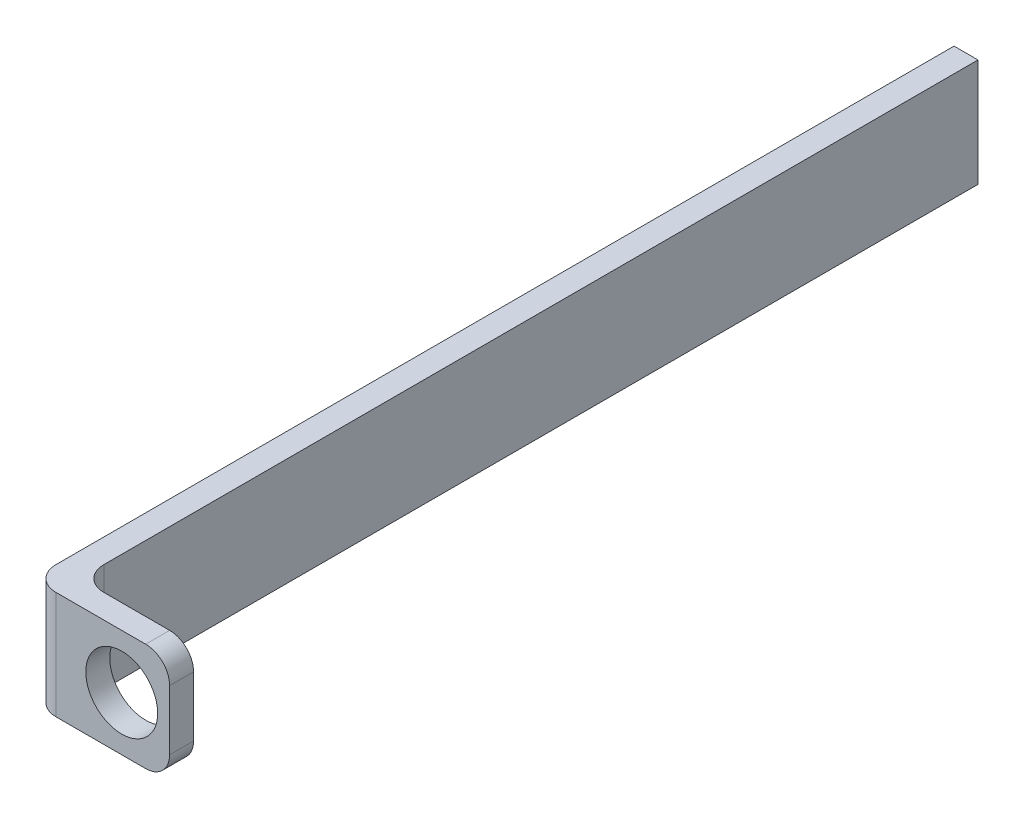
ISO-10303-21;
HEADER;
FILE_DESCRIPTION(('STEP AP214'),'2;1');
FILE_NAME('part.step','',(''),(''),'','','');
FILE_SCHEMA(('AUTOMOTIVE_DESIGN { 1 0 10303 214 1 1 1 1 }'));
ENDSEC;
DATA;
#1=APPLICATION_CONTEXT('core data for automotive mechanical design processes');
#2=APPLICATION_PROTOCOL_DEFINITION('international standard','automotive_design',2000,#1);
#3=PRODUCT_CONTEXT('',#1,'mechanical');
#4=PRODUCT('Part','Part','',(#3));
#5=PRODUCT_RELATED_PRODUCT_CATEGORY('part','',(#4));
#6=PRODUCT_DEFINITION_FORMATION('','',#4);
#7=PRODUCT_DEFINITION_CONTEXT('part definition',#1,'design');
#8=PRODUCT_DEFINITION('design','',#6,#7);
#9=PRODUCT_DEFINITION_SHAPE('','',#8);
#10=(LENGTH_UNIT() NAMED_UNIT(*) SI_UNIT(.MILLI.,.METRE.));
#11=(NAMED_UNIT(*) PLANE_ANGLE_UNIT() SI_UNIT($,.RADIAN.));
#12=(NAMED_UNIT(*) SI_UNIT($,.STERADIAN.) SOLID_ANGLE_UNIT());
#13=UNCERTAINTY_MEASURE_WITH_UNIT(LENGTH_MEASURE(1.E-05),#10,'distance_accuracy_value','');
#14=(GEOMETRIC_REPRESENTATION_CONTEXT(3) GLOBAL_UNCERTAINTY_ASSIGNED_CONTEXT((#13)) GLOBAL_UNIT_ASSIGNED_CONTEXT((#10,
#11,#12)) REPRESENTATION_CONTEXT('',''));
#15=CARTESIAN_POINT('',(0.,0.,0.));
#16=DIRECTION('',(0.,0.,1.));
#17=DIRECTION('',(1.,0.,0.));
#18=AXIS2_PLACEMENT_3D('',#15,#16,#17);
#19=CARTESIAN_POINT('',(1.99999999999999,-2.5,0.));
#20=DIRECTION('',(0.,0.,1.));
#21=DIRECTION('',(1.,0.,0.));
#22=AXIS2_PLACEMENT_3D('',#19,#20,#21);
#23=PLANE('',#22);
#24=CARTESIAN_POINT('',(0.,0.,0.));
#25=DIRECTION('',(0.,0.,1.));
#26=DIRECTION('',(1.,0.,0.));
#27=AXIS2_PLACEMENT_3D('',#24,#25,#26);
#28=CIRCLE('',#27,3.);
#29=CARTESIAN_POINT('',(3.,0.,0.));
#30=VERTEX_POINT('',#29);
#31=EDGE_CURVE('E153',#30,#30,#28,.T.);
#32=ORIENTED_EDGE('',*,*,#31,.T.);
#33=EDGE_LOOP('',(#32));
#34=FACE_BOUND('',#33,.T.);
#35=DIRECTION('',(1.,0.,0.));
#36=VECTOR('',#35,1.);
#37=CARTESIAN_POINT('',(-7.5,-4.5,0.));
#38=LINE('',#37,#36);
#39=CARTESIAN_POINT('',(-3.5,-4.5,0.));
#40=VERTEX_POINT('',#39);
#41=CARTESIAN_POINT('',(1.99999999999999,-4.5,0.));
#42=VERTEX_POINT('',#41);
#43=EDGE_CURVE('E158',#40,#42,#38,.T.);
#44=ORIENTED_EDGE('',*,*,#43,.F.);
#45=DIRECTION('',(0.,-1.,0.));
#46=VECTOR('',#45,1.);
#47=CARTESIAN_POINT('',(-3.5,4.5,0.));
#48=LINE('',#47,#46);
#49=CARTESIAN_POINT('',(-3.5,4.5,0.));
#50=VERTEX_POINT('',#49);
#51=EDGE_CURVE('E214',#40,#50,#48,.F.);
#52=ORIENTED_EDGE('',*,*,#51,.T.);
#53=DIRECTION('',(-1.,0.,0.));
#54=VECTOR('',#53,1.);
#55=CARTESIAN_POINT('',(-7.5,4.5,0.));
#56=LINE('',#55,#54);
#57=CARTESIAN_POINT('',(1.99999999999999,4.5,0.));
#58=VERTEX_POINT('',#57);
#59=EDGE_CURVE('E166',#58,#50,#56,.T.);
#60=ORIENTED_EDGE('',*,*,#59,.F.);
#61=CARTESIAN_POINT('',(1.99999999999999,2.5,0.));
#62=DIRECTION('',(0.,0.,1.));
#63=DIRECTION('',(-1.,0.,0.));
#64=AXIS2_PLACEMENT_3D('',#61,#62,#63);
#65=CIRCLE('',#64,2.);
#66=CARTESIAN_POINT('',(3.99999999999999,2.5,0.));
#67=VERTEX_POINT('',#66);
#68=EDGE_CURVE('E186',#67,#58,#65,.T.);
#69=ORIENTED_EDGE('',*,*,#68,.F.);
#70=DIRECTION('',(0.,1.,0.));
#71=VECTOR('',#70,1.);
#72=CARTESIAN_POINT('',(3.99999999999999,2.5,0.));
#73=LINE('',#72,#71);
#74=CARTESIAN_POINT('',(3.99999999999999,-2.5,0.));
#75=VERTEX_POINT('',#74);
#76=EDGE_CURVE('E183',#75,#67,#73,.T.);
#77=ORIENTED_EDGE('',*,*,#76,.F.);
#78=CARTESIAN_POINT('',(1.99999999999999,-2.5,0.));
#79=DIRECTION('',(0.,0.,1.));
#80=DIRECTION('',(1.,0.,0.));
#81=AXIS2_PLACEMENT_3D('',#78,#79,#80);
#82=CIRCLE('',#81,2.);
#83=EDGE_CURVE('E180',#42,#75,#82,.T.);
#84=ORIENTED_EDGE('',*,*,#83,.F.);
#85=EDGE_LOOP('',(#44,#52,#60,#69,#77,#84));
#86=FACE_BOUND('',#85,.T.);
#87=ADVANCED_FACE('F40',(#34,#86),#23,.F.);
#88=CARTESIAN_POINT('',(1.99999999999999,-2.5,2.));
#89=DIRECTION('',(0.,0.,1.));
#90=DIRECTION('',(1.,0.,0.));
#91=AXIS2_PLACEMENT_3D('',#88,#89,#90);
#92=PLANE('',#91);
#93=DIRECTION('',(-1.,0.,0.));
#94=VECTOR('',#93,1.);
#95=CARTESIAN_POINT('',(-7.5,4.5,2.));
#96=LINE('',#95,#94);
#97=CARTESIAN_POINT('',(1.99999999999999,4.5,2.));
#98=VERTEX_POINT('',#97);
#99=CARTESIAN_POINT('',(-5.5,4.5,2.));
#100=VERTEX_POINT('',#99);
#101=EDGE_CURVE('E124',#98,#100,#96,.T.);
#102=ORIENTED_EDGE('',*,*,#101,.T.);
#103=DIRECTION('',(0.,-1.,0.));
#104=VECTOR('',#103,1.);
#105=CARTESIAN_POINT('',(-5.5,-4.5,2.));
#106=LINE('',#105,#104);
#107=CARTESIAN_POINT('',(-5.5,-4.5,2.));
#108=VERTEX_POINT('',#107);
#109=EDGE_CURVE('E217',#100,#108,#106,.T.);
#110=ORIENTED_EDGE('',*,*,#109,.T.);
#111=DIRECTION('',(1.,0.,0.));
#112=VECTOR('',#111,1.);
#113=CARTESIAN_POINT('',(-7.5,-4.5,2.));
#114=LINE('',#113,#112);
#115=CARTESIAN_POINT('',(1.99999999999999,-4.5,2.));
#116=VERTEX_POINT('',#115);
#117=EDGE_CURVE('E162',#108,#116,#114,.T.);
#118=ORIENTED_EDGE('',*,*,#117,.T.);
#119=CARTESIAN_POINT('',(1.99999999999999,-2.5,2.));
#120=DIRECTION('',(0.,0.,1.));
#121=DIRECTION('',(1.,0.,0.));
#122=AXIS2_PLACEMENT_3D('',#119,#120,#121);
#123=CIRCLE('',#122,2.);
#124=CARTESIAN_POINT('',(3.99999999999999,-2.5,2.));
#125=VERTEX_POINT('',#124);
#126=EDGE_CURVE('E165',#116,#125,#123,.T.);
#127=ORIENTED_EDGE('',*,*,#126,.T.);
#128=DIRECTION('',(0.,1.,0.));
#129=VECTOR('',#128,1.);
#130=CARTESIAN_POINT('',(3.99999999999999,2.5,2.));
#131=LINE('',#130,#129);
#132=CARTESIAN_POINT('',(3.99999999999999,2.5,2.));
#133=VERTEX_POINT('',#132);
#134=EDGE_CURVE('E169',#125,#133,#131,.T.);
#135=ORIENTED_EDGE('',*,*,#134,.T.);
#136=CARTESIAN_POINT('',(1.99999999999999,2.5,2.));
#137=DIRECTION('',(0.,0.,1.));
#138=DIRECTION('',(-1.,0.,0.));
#139=AXIS2_PLACEMENT_3D('',#136,#137,#138);
#140=CIRCLE('',#139,2.);
#141=EDGE_CURVE('E172',#133,#98,#140,.T.);
#142=ORIENTED_EDGE('',*,*,#141,.T.);
#143=EDGE_LOOP('',(#102,#110,#118,#127,#135,#142));
#144=FACE_BOUND('',#143,.T.);
#145=CARTESIAN_POINT('',(0.,0.,2.));
#146=DIRECTION('',(0.,0.,1.));
#147=DIRECTION('',(1.,0.,0.));
#148=AXIS2_PLACEMENT_3D('',#145,#146,#147);
#149=CIRCLE('',#148,3.);
#150=CARTESIAN_POINT('',(3.,0.,2.));
#151=VERTEX_POINT('',#150);
#152=EDGE_CURVE('E154',#151,#151,#149,.T.);
#153=ORIENTED_EDGE('',*,*,#152,.F.);
#154=EDGE_LOOP('',(#153));
#155=FACE_BOUND('',#154,.T.);
#156=ADVANCED_FACE('F247',(#144,#155),#92,.T.);
#157=CARTESIAN_POINT('',(-7.5,4.5,2.));
#158=DIRECTION('',(1.,0.,0.));
#159=DIRECTION('',(0.,0.,-1.));
#160=AXIS2_PLACEMENT_3D('',#157,#158,#159);
#161=PLANE('',#160);
#162=DIRECTION('',(0.,0.,-1.));
#163=VECTOR('',#162,1.);
#164=CARTESIAN_POINT('',(-7.5,-4.5,2.));
#165=LINE('',#164,#163);
#166=CARTESIAN_POINT('',(-7.5,-4.5,0.));
#167=VERTEX_POINT('',#166);
#168=CARTESIAN_POINT('',(-7.5,-4.5,-75.));
#169=VERTEX_POINT('',#168);
#170=EDGE_CURVE('E207',#167,#169,#165,.T.);
#171=ORIENTED_EDGE('',*,*,#170,.F.);
#172=DIRECTION('',(0.,-1.,0.));
#173=VECTOR('',#172,1.);
#174=CARTESIAN_POINT('',(-7.5,4.5,0.));
#175=LINE('',#174,#173);
#176=CARTESIAN_POINT('',(-7.5,4.5,0.));
#177=VERTEX_POINT('',#176);
#178=EDGE_CURVE('E56',#167,#177,#175,.F.);
#179=ORIENTED_EDGE('',*,*,#178,.T.);
#180=DIRECTION('',(0.,0.,-1.));
#181=VECTOR('',#180,1.);
#182=CARTESIAN_POINT('',(-7.5,4.5,2.));
#183=LINE('',#182,#181);
#184=CARTESIAN_POINT('',(-7.5,4.5,-75.));
#185=VERTEX_POINT('',#184);
#186=EDGE_CURVE('E115',#177,#185,#183,.T.);
#187=ORIENTED_EDGE('',*,*,#186,.T.);
#188=DIRECTION('',(0.,1.,0.));
#189=VECTOR('',#188,1.);
#190=CARTESIAN_POINT('',(-7.5,4.5,-75.));
#191=LINE('',#190,#189);
#192=EDGE_CURVE('E119',#169,#185,#191,.T.);
#193=ORIENTED_EDGE('',*,*,#192,.F.);
#194=EDGE_LOOP('',(#171,#179,#187,#193));
#195=FACE_BOUND('',#194,.T.);
#196=ADVANCED_FACE('F117',(#195),#161,.F.);
#197=CARTESIAN_POINT('',(-7.5,-4.5,2.));
#198=DIRECTION('',(0.,1.,0.));
#199=DIRECTION('',(-1.,0.,0.));
#200=AXIS2_PLACEMENT_3D('',#197,#198,#199);
#201=PLANE('',#200);
#202=ORIENTED_EDGE('',*,*,#117,.F.);
#203=CARTESIAN_POINT('',(-5.5,-4.5,0.));
#204=DIRECTION('',(0.,1.,0.));
#205=DIRECTION('',(-1.,0.,0.));
#206=AXIS2_PLACEMENT_3D('',#203,#204,#205);
#207=CIRCLE('',#206,2.);
#208=EDGE_CURVE('E64',#108,#167,#207,.F.);
#209=ORIENTED_EDGE('',*,*,#208,.T.);
#210=ORIENTED_EDGE('',*,*,#170,.T.);
#211=DIRECTION('',(-1.,0.,0.));
#212=VECTOR('',#211,1.);
#213=CARTESIAN_POINT('',(-7.5,-4.5,-75.));
#214=LINE('',#213,#212);
#215=CARTESIAN_POINT('',(-5.5,-4.5,-75.));
#216=VERTEX_POINT('',#215);
#217=EDGE_CURVE('E139',#216,#169,#214,.T.);
#218=ORIENTED_EDGE('',*,*,#217,.F.);
#219=DIRECTION('',(0.,0.,1.));
#220=VECTOR('',#219,1.);
#221=CARTESIAN_POINT('',(-5.5,-4.5,-75.));
#222=LINE('',#221,#220);
#223=CARTESIAN_POINT('',(-5.5,-4.5,-2.));
#224=VERTEX_POINT('',#223);
#225=EDGE_CURVE('E147',#216,#224,#222,.T.);
#226=ORIENTED_EDGE('',*,*,#225,.T.);
#227=CARTESIAN_POINT('',(-3.5,-4.5,-2.));
#228=DIRECTION('',(0.,1.,0.));
#229=DIRECTION('',(-1.,0.,0.));
#230=AXIS2_PLACEMENT_3D('',#227,#228,#229);
#231=CIRCLE('',#230,2.);
#232=EDGE_CURVE('E49',#224,#40,#231,.T.);
#233=ORIENTED_EDGE('',*,*,#232,.T.);
#234=ORIENTED_EDGE('',*,*,#43,.T.);
#235=DIRECTION('',(0.,0.,-1.));
#236=VECTOR('',#235,1.);
#237=CARTESIAN_POINT('',(1.99999999999999,-4.5,2.));
#238=LINE('',#237,#236);
#239=EDGE_CURVE('E203',#116,#42,#238,.T.);
#240=ORIENTED_EDGE('',*,*,#239,.F.);
#241=EDGE_LOOP('',(#202,#209,#210,#218,#226,#233,#234,#240));
#242=FACE_BOUND('',#241,.T.);
#243=ADVANCED_FACE('F229',(#242),#201,.F.);
#244=CARTESIAN_POINT('',(1.99999999999999,-2.5,2.));
#245=DIRECTION('',(0.,0.,-1.));
#246=DIRECTION('',(-1.,0.,0.));
#247=AXIS2_PLACEMENT_3D('',#244,#245,#246);
#248=CYLINDRICAL_SURFACE('',#247,2.);
#249=ORIENTED_EDGE('',*,*,#83,.T.);
#250=DIRECTION('',(0.,0.,-1.));
#251=VECTOR('',#250,1.);
#252=CARTESIAN_POINT('',(3.99999999999999,-2.5,2.));
#253=LINE('',#252,#251);
#254=EDGE_CURVE('E199',#125,#75,#253,.T.);
#255=ORIENTED_EDGE('',*,*,#254,.F.);
#256=ORIENTED_EDGE('',*,*,#126,.F.);
#257=ORIENTED_EDGE('',*,*,#239,.T.);
#258=EDGE_LOOP('',(#249,#255,#256,#257));
#259=FACE_BOUND('',#258,.T.);
#260=ADVANCED_FACE('F261',(#259),#248,.T.);
#261=CARTESIAN_POINT('',(3.99999999999999,2.5,2.));
#262=DIRECTION('',(-1.,0.,0.));
#263=DIRECTION('',(0.,0.,1.));
#264=AXIS2_PLACEMENT_3D('',#261,#262,#263);
#265=PLANE('',#264);
#266=ORIENTED_EDGE('',*,*,#76,.T.);
#267=DIRECTION('',(0.,0.,-1.));
#268=VECTOR('',#267,1.);
#269=CARTESIAN_POINT('',(3.99999999999999,2.5,2.));
#270=LINE('',#269,#268);
#271=EDGE_CURVE('E195',#133,#67,#270,.T.);
#272=ORIENTED_EDGE('',*,*,#271,.F.);
#273=ORIENTED_EDGE('',*,*,#134,.F.);
#274=ORIENTED_EDGE('',*,*,#254,.T.);
#275=EDGE_LOOP('',(#266,#272,#273,#274));
#276=FACE_BOUND('',#275,.T.);
#277=ADVANCED_FACE('F257',(#276),#265,.F.);
#278=CARTESIAN_POINT('',(1.99999999999999,2.5,2.));
#279=DIRECTION('',(0.,0.,-1.));
#280=DIRECTION('',(-1.,0.,0.));
#281=AXIS2_PLACEMENT_3D('',#278,#279,#280);
#282=CYLINDRICAL_SURFACE('',#281,2.);
#283=ORIENTED_EDGE('',*,*,#68,.T.);
#284=DIRECTION('',(0.,0.,-1.));
#285=VECTOR('',#284,1.);
#286=CARTESIAN_POINT('',(1.99999999999999,4.5,2.));
#287=LINE('',#286,#285);
#288=EDGE_CURVE('E123',#98,#58,#287,.T.);
#289=ORIENTED_EDGE('',*,*,#288,.F.);
#290=ORIENTED_EDGE('',*,*,#141,.F.);
#291=ORIENTED_EDGE('',*,*,#271,.T.);
#292=EDGE_LOOP('',(#283,#289,#290,#291));
#293=FACE_BOUND('',#292,.T.);
#294=ADVANCED_FACE('F254',(#293),#282,.T.);
#295=CARTESIAN_POINT('',(-7.5,4.5,2.));
#296=DIRECTION('',(0.,-1.,0.));
#297=DIRECTION('',(1.,0.,0.));
#298=AXIS2_PLACEMENT_3D('',#295,#296,#297);
#299=PLANE('',#298);
#300=ORIENTED_EDGE('',*,*,#186,.F.);
#301=CARTESIAN_POINT('',(-5.5,4.5,0.));
#302=DIRECTION('',(0.,-1.,0.));
#303=DIRECTION('',(1.,0.,0.));
#304=AXIS2_PLACEMENT_3D('',#301,#302,#303);
#305=CIRCLE('',#304,2.);
#306=EDGE_CURVE('E225',#177,#100,#305,.F.);
#307=ORIENTED_EDGE('',*,*,#306,.T.);
#308=ORIENTED_EDGE('',*,*,#101,.F.);
#309=ORIENTED_EDGE('',*,*,#288,.T.);
#310=ORIENTED_EDGE('',*,*,#59,.T.);
#311=CARTESIAN_POINT('',(-3.5,4.5,-2.));
#312=DIRECTION('',(0.,-1.,0.));
#313=DIRECTION('',(1.,0.,0.));
#314=AXIS2_PLACEMENT_3D('',#311,#312,#313);
#315=CIRCLE('',#314,2.);
#316=CARTESIAN_POINT('',(-5.5,4.5,-2.));
#317=VERTEX_POINT('',#316);
#318=EDGE_CURVE('E11',#50,#317,#315,.T.);
#319=ORIENTED_EDGE('',*,*,#318,.T.);
#320=DIRECTION('',(0.,0.,1.));
#321=VECTOR('',#320,1.);
#322=CARTESIAN_POINT('',(-5.5,4.5,-75.));
#323=LINE('',#322,#321);
#324=CARTESIAN_POINT('',(-5.5,4.5,-75.));
#325=VERTEX_POINT('',#324);
#326=EDGE_CURVE('E130',#325,#317,#323,.T.);
#327=ORIENTED_EDGE('',*,*,#326,.F.);
#328=DIRECTION('',(1.,0.,0.));
#329=VECTOR('',#328,1.);
#330=CARTESIAN_POINT('',(-7.5,4.5,-75.));
#331=LINE('',#330,#329);
#332=EDGE_CURVE('E127',#185,#325,#331,.T.);
#333=ORIENTED_EDGE('',*,*,#332,.F.);
#334=EDGE_LOOP('',(#300,#307,#308,#309,#310,#319,#327,#333));
#335=FACE_BOUND('',#334,.T.);
#336=ADVANCED_FACE('F128',(#335),#299,.F.);
#337=CARTESIAN_POINT('',(0.,0.,2.));
#338=DIRECTION('',(0.,0.,-1.));
#339=DIRECTION('',(-1.,0.,0.));
#340=AXIS2_PLACEMENT_3D('',#337,#338,#339);
#341=CYLINDRICAL_SURFACE('',#340,3.);
#342=ORIENTED_EDGE('',*,*,#152,.T.);
#343=EDGE_LOOP('',(#342));
#344=FACE_BOUND('',#343,.T.);
#345=ORIENTED_EDGE('',*,*,#31,.F.);
#346=EDGE_LOOP('',(#345));
#347=FACE_BOUND('',#346,.T.);
#348=ADVANCED_FACE('F279',(#344,#347),#341,.F.);
#349=CARTESIAN_POINT('',(-5.5,4.5,-75.));
#350=DIRECTION('',(-1.,0.,0.));
#351=DIRECTION('',(0.,-1.,0.));
#352=AXIS2_PLACEMENT_3D('',#349,#350,#351);
#353=PLANE('',#352);
#354=ORIENTED_EDGE('',*,*,#326,.T.);
#355=DIRECTION('',(0.,-1.,0.));
#356=VECTOR('',#355,1.);
#357=CARTESIAN_POINT('',(-5.5,-4.5,-2.));
#358=LINE('',#357,#356);
#359=EDGE_CURVE('E210',#317,#224,#358,.T.);
#360=ORIENTED_EDGE('',*,*,#359,.T.);
#361=ORIENTED_EDGE('',*,*,#225,.F.);
#362=DIRECTION('',(0.,-1.,0.));
#363=VECTOR('',#362,1.);
#364=CARTESIAN_POINT('',(-5.5,4.5,-75.));
#365=LINE('',#364,#363);
#366=EDGE_CURVE('E134',#325,#216,#365,.T.);
#367=ORIENTED_EDGE('',*,*,#366,.F.);
#368=EDGE_LOOP('',(#354,#360,#361,#367));
#369=FACE_BOUND('',#368,.T.);
#370=ADVANCED_FACE('F242',(#369),#353,.F.);
#371=CARTESIAN_POINT('',(0.,0.,-75.));
#372=DIRECTION('',(0.,0.,1.));
#373=DIRECTION('',(1.,0.,0.));
#374=AXIS2_PLACEMENT_3D('',#371,#372,#373);
#375=PLANE('',#374);
#376=ORIENTED_EDGE('',*,*,#192,.T.);
#377=ORIENTED_EDGE('',*,*,#332,.T.);
#378=ORIENTED_EDGE('',*,*,#366,.T.);
#379=ORIENTED_EDGE('',*,*,#217,.T.);
#380=EDGE_LOOP('',(#376,#377,#378,#379));
#381=FACE_BOUND('',#380,.T.);
#382=ADVANCED_FACE('F137',(#381),#375,.F.);
#383=CARTESIAN_POINT('',(-3.5,4.5,-2.));
#384=DIRECTION('',(0.,1.,0.));
#385=DIRECTION('',(-1.,0.,0.));
#386=AXIS2_PLACEMENT_3D('',#383,#384,#385);
#387=CYLINDRICAL_SURFACE('',#386,2.);
#388=ORIENTED_EDGE('',*,*,#318,.F.);
#389=ORIENTED_EDGE('',*,*,#51,.F.);
#390=ORIENTED_EDGE('',*,*,#232,.F.);
#391=ORIENTED_EDGE('',*,*,#359,.F.);
#392=EDGE_LOOP('',(#388,#389,#390,#391));
#393=FACE_BOUND('',#392,.T.);
#394=ADVANCED_FACE('F240',(#393),#387,.F.);
#395=CARTESIAN_POINT('',(-5.5,-2.5,0.));
#396=DIRECTION('',(0.,1.,0.));
#397=DIRECTION('',(0.,0.,1.));
#398=AXIS2_PLACEMENT_3D('',#395,#396,#397);
#399=CYLINDRICAL_SURFACE('',#398,2.);
#400=ORIENTED_EDGE('',*,*,#306,.F.);
#401=ORIENTED_EDGE('',*,*,#178,.F.);
#402=ORIENTED_EDGE('',*,*,#208,.F.);
#403=ORIENTED_EDGE('',*,*,#109,.F.);
#404=EDGE_LOOP('',(#400,#401,#402,#403));
#405=FACE_BOUND('',#404,.T.);
#406=ADVANCED_FACE('F42',(#405),#399,.T.);
#407=CLOSED_SHELL('',(#87,#156,#196,#243,#260,#277,#294,#336,#348,#370,#382,#394,#406));
#408=MANIFOLD_SOLID_BREP('B2',#407);
#409=ADVANCED_BREP_SHAPE_REPRESENTATION('',(#18,#408),#14);
#410=SHAPE_DEFINITION_REPRESENTATION(#9,#409);
ENDSEC;
END-ISO-10303-21;
